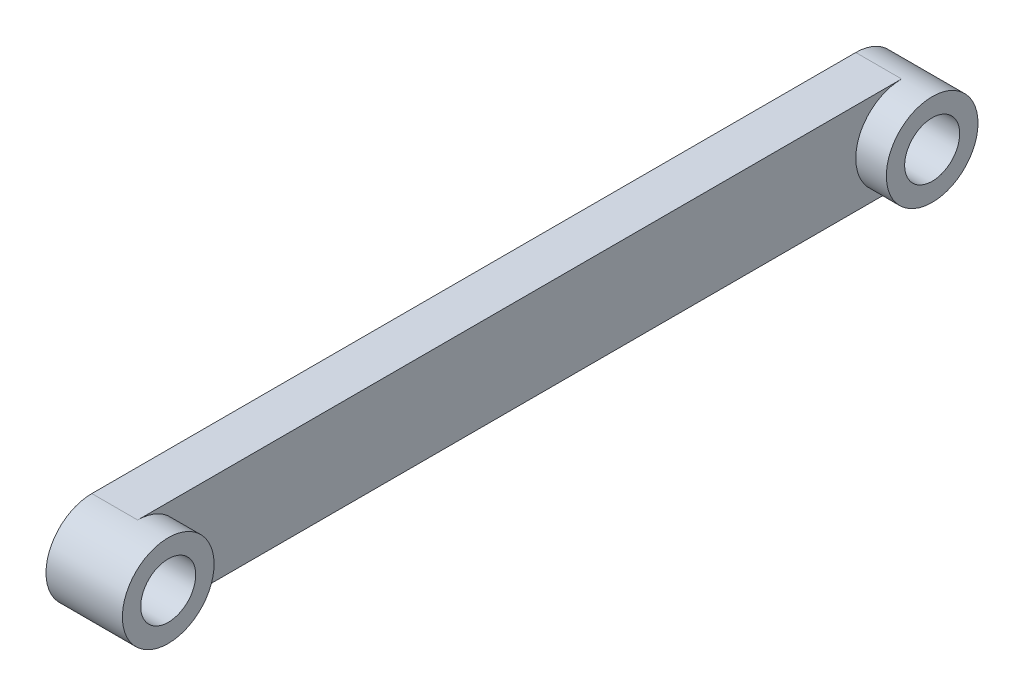
ISO-10303-21;
HEADER;
FILE_DESCRIPTION(('STEP AP214'),'2;1');
FILE_NAME('part.step','',(''),(''),'','','');
FILE_SCHEMA(('AUTOMOTIVE_DESIGN { 1 0 10303 214 1 1 1 1 }'));
ENDSEC;
DATA;
#1=APPLICATION_CONTEXT('core data for automotive mechanical design processes');
#2=APPLICATION_PROTOCOL_DEFINITION('international standard','automotive_design',2000,#1);
#3=PRODUCT_CONTEXT('',#1,'mechanical');
#4=PRODUCT('Part','Part','',(#3));
#5=PRODUCT_RELATED_PRODUCT_CATEGORY('part','',(#4));
#6=PRODUCT_DEFINITION_FORMATION('','',#4);
#7=PRODUCT_DEFINITION_CONTEXT('part definition',#1,'design');
#8=PRODUCT_DEFINITION('design','',#6,#7);
#9=PRODUCT_DEFINITION_SHAPE('','',#8);
#10=(LENGTH_UNIT() NAMED_UNIT(*) SI_UNIT(.MILLI.,.METRE.));
#11=(NAMED_UNIT(*) PLANE_ANGLE_UNIT() SI_UNIT($,.RADIAN.));
#12=(NAMED_UNIT(*) SI_UNIT($,.STERADIAN.) SOLID_ANGLE_UNIT());
#13=UNCERTAINTY_MEASURE_WITH_UNIT(LENGTH_MEASURE(1.E-05),#10,'distance_accuracy_value','');
#14=(GEOMETRIC_REPRESENTATION_CONTEXT(3) GLOBAL_UNCERTAINTY_ASSIGNED_CONTEXT((#13)) GLOBAL_UNIT_ASSIGNED_CONTEXT((#10,
#11,#12)) REPRESENTATION_CONTEXT('',''));
#15=CARTESIAN_POINT('',(0.,0.,0.));
#16=DIRECTION('',(0.,0.,1.));
#17=DIRECTION('',(1.,0.,0.));
#18=AXIS2_PLACEMENT_3D('',#15,#16,#17);
#19=CARTESIAN_POINT('',(3.,6.5627112660641,66.6032583111451));
#20=DIRECTION('',(1.,0.,0.));
#21=DIRECTION('',(0.,0.,-1.));
#22=AXIS2_PLACEMENT_3D('',#19,#20,#21);
#23=PLANE('',#22);
#24=DIRECTION('',(0.,0.,-1.));
#25=VECTOR('',#24,1.);
#26=CARTESIAN_POINT('',(3.,3.5627112660641,66.6032583111451));
#27=LINE('',#26,#25);
#28=CARTESIAN_POINT('',(3.,3.5627112660641,66.6032583111451));
#29=VERTEX_POINT('',#28);
#30=CARTESIAN_POINT('',(3.,3.5627112660641,16.6032583111451));
#31=VERTEX_POINT('',#30);
#32=EDGE_CURVE('E58',#29,#31,#27,.T.);
#33=ORIENTED_EDGE('',*,*,#32,.T.);
#34=CARTESIAN_POINT('',(3.,6.5627112660641,16.6032583111451));
#35=DIRECTION('',(1.,0.,0.));
#36=DIRECTION('',(0.,0.,-1.));
#37=AXIS2_PLACEMENT_3D('',#34,#35,#36);
#38=CIRCLE('',#37,3.);
#39=CARTESIAN_POINT('',(3.,9.5627112660641,16.6032583111451));
#40=VERTEX_POINT('',#39);
#41=EDGE_CURVE('E140',#40,#31,#38,.T.);
#42=ORIENTED_EDGE('',*,*,#41,.F.);
#43=DIRECTION('',(0.,0.,1.));
#44=VECTOR('',#43,1.);
#45=CARTESIAN_POINT('',(3.,9.5627112660641,66.6032583111451));
#46=LINE('',#45,#44);
#47=CARTESIAN_POINT('',(3.,9.56271126606411,66.6032583111451));
#48=VERTEX_POINT('',#47);
#49=EDGE_CURVE('E98',#40,#48,#46,.T.);
#50=ORIENTED_EDGE('',*,*,#49,.T.);
#51=CARTESIAN_POINT('',(3.,6.5627112660641,66.6032583111451));
#52=DIRECTION('',(1.,0.,0.));
#53=DIRECTION('',(0.,0.,-1.));
#54=AXIS2_PLACEMENT_3D('',#51,#52,#53);
#55=CIRCLE('',#54,3.00000000000001);
#56=EDGE_CURVE('E11',#29,#48,#55,.T.);
#57=ORIENTED_EDGE('',*,*,#56,.F.);
#58=EDGE_LOOP('',(#33,#42,#50,#57));
#59=FACE_BOUND('',#58,.T.);
#60=ADVANCED_FACE('F39',(#59),#23,.T.);
#61=CARTESIAN_POINT('',(0.,6.5627112660641,66.6032583111451));
#62=DIRECTION('',(1.,0.,0.));
#63=DIRECTION('',(0.,0.,-1.));
#64=AXIS2_PLACEMENT_3D('',#61,#62,#63);
#65=PLANE('',#64);
#66=CARTESIAN_POINT('',(0.,6.5627112660641,66.6032583111451));
#67=DIRECTION('',(1.,0.,0.));
#68=DIRECTION('',(0.,0.,-1.));
#69=AXIS2_PLACEMENT_3D('',#66,#67,#68);
#70=CIRCLE('',#69,3.);
#71=CARTESIAN_POINT('',(0.,9.5627112660641,66.6032583111451));
#72=VERTEX_POINT('',#71);
#73=CARTESIAN_POINT('',(0.,3.5627112660641,66.6032583111451));
#74=VERTEX_POINT('',#73);
#75=EDGE_CURVE('E96',#72,#74,#70,.T.);
#76=ORIENTED_EDGE('',*,*,#75,.F.);
#77=DIRECTION('',(0.,0.,1.));
#78=VECTOR('',#77,1.);
#79=CARTESIAN_POINT('',(0.,9.5627112660641,66.6032583111451));
#80=LINE('',#79,#78);
#81=CARTESIAN_POINT('',(0.,9.5627112660641,16.6032583111451));
#82=VERTEX_POINT('',#81);
#83=EDGE_CURVE('E81',#82,#72,#80,.T.);
#84=ORIENTED_EDGE('',*,*,#83,.F.);
#85=CARTESIAN_POINT('',(0.,6.5627112660641,16.6032583111451));
#86=DIRECTION('',(1.,0.,0.));
#87=DIRECTION('',(0.,0.,-1.));
#88=AXIS2_PLACEMENT_3D('',#85,#86,#87);
#89=CIRCLE('',#88,3.);
#90=CARTESIAN_POINT('',(0.,3.5627112660641,16.6032583111451));
#91=VERTEX_POINT('',#90);
#92=EDGE_CURVE('E75',#91,#82,#89,.T.);
#93=ORIENTED_EDGE('',*,*,#92,.F.);
#94=DIRECTION('',(0.,0.,-1.));
#95=VECTOR('',#94,1.);
#96=CARTESIAN_POINT('',(0.,3.5627112660641,66.6032583111451));
#97=LINE('',#96,#95);
#98=EDGE_CURVE('E102',#74,#91,#97,.T.);
#99=ORIENTED_EDGE('',*,*,#98,.F.);
#100=EDGE_LOOP('',(#76,#84,#93,#99));
#101=FACE_BOUND('',#100,.T.);
#102=CARTESIAN_POINT('',(0.,6.5627112660641,66.6032583111451));
#103=DIRECTION('',(1.,0.,0.));
#104=DIRECTION('',(0.,0.,-1.));
#105=AXIS2_PLACEMENT_3D('',#102,#103,#104);
#106=CIRCLE('',#105,1.79999999999999);
#107=CARTESIAN_POINT('',(0.,6.5627112660641,64.8032583111451));
#108=VERTEX_POINT('',#107);
#109=EDGE_CURVE('E105',#108,#108,#106,.T.);
#110=ORIENTED_EDGE('',*,*,#109,.T.);
#111=EDGE_LOOP('',(#110));
#112=FACE_BOUND('',#111,.T.);
#113=CARTESIAN_POINT('',(0.,6.5627112660641,16.6032583111451));
#114=DIRECTION('',(1.,0.,0.));
#115=DIRECTION('',(0.,0.,-1.));
#116=AXIS2_PLACEMENT_3D('',#113,#114,#115);
#117=CIRCLE('',#116,1.8);
#118=CARTESIAN_POINT('',(0.,6.5627112660641,14.8032583111451));
#119=VERTEX_POINT('',#118);
#120=EDGE_CURVE('E111',#119,#119,#117,.T.);
#121=ORIENTED_EDGE('',*,*,#120,.T.);
#122=EDGE_LOOP('',(#121));
#123=FACE_BOUND('',#122,.T.);
#124=ADVANCED_FACE('F100',(#101,#112,#123),#65,.F.);
#125=CARTESIAN_POINT('',(3.,6.5627112660641,66.6032583111451));
#126=DIRECTION('',(-1.,0.,0.));
#127=DIRECTION('',(0.,0.,1.));
#128=AXIS2_PLACEMENT_3D('',#125,#126,#127);
#129=CYLINDRICAL_SURFACE('',#128,3.);
#130=ORIENTED_EDGE('',*,*,#75,.T.);
#131=DIRECTION('',(-1.,0.,0.));
#132=VECTOR('',#131,1.);
#133=CARTESIAN_POINT('',(3.,3.5627112660641,66.6032583111451));
#134=LINE('',#133,#132);
#135=EDGE_CURVE('E43',#29,#74,#134,.T.);
#136=ORIENTED_EDGE('',*,*,#135,.F.);
#137=ORIENTED_EDGE('',*,*,#56,.T.);
#138=DIRECTION('',(-1.,0.,0.));
#139=VECTOR('',#138,1.);
#140=CARTESIAN_POINT('',(3.,9.5627112660641,66.6032583111451));
#141=LINE('',#140,#139);
#142=EDGE_CURVE('E85',#48,#72,#141,.T.);
#143=ORIENTED_EDGE('',*,*,#142,.T.);
#144=EDGE_LOOP('',(#130,#136,#137,#143));
#145=FACE_BOUND('',#144,.T.);
#146=CARTESIAN_POINT('',(5.,6.5627112660641,66.6032583111451));
#147=DIRECTION('',(1.,0.,0.));
#148=DIRECTION('',(0.,0.,-1.));
#149=AXIS2_PLACEMENT_3D('',#146,#147,#148);
#150=CIRCLE('',#149,3.00000000000001);
#151=CARTESIAN_POINT('',(5.,6.5627112660641,63.6032583111451));
#152=VERTEX_POINT('',#151);
#153=EDGE_CURVE('E130',#152,#152,#150,.T.);
#154=ORIENTED_EDGE('',*,*,#153,.F.);
#155=EDGE_LOOP('',(#154));
#156=FACE_BOUND('',#155,.T.);
#157=ADVANCED_FACE('F41',(#145,#156),#129,.T.);
#158=CARTESIAN_POINT('',(3.,3.5627112660641,66.6032583111451));
#159=DIRECTION('',(0.,1.,0.));
#160=DIRECTION('',(0.,0.,1.));
#161=AXIS2_PLACEMENT_3D('',#158,#159,#160);
#162=PLANE('',#161);
#163=ORIENTED_EDGE('',*,*,#98,.T.);
#164=DIRECTION('',(-1.,0.,0.));
#165=VECTOR('',#164,1.);
#166=CARTESIAN_POINT('',(3.,3.5627112660641,16.6032583111451));
#167=LINE('',#166,#165);
#168=EDGE_CURVE('E119',#31,#91,#167,.T.);
#169=ORIENTED_EDGE('',*,*,#168,.F.);
#170=ORIENTED_EDGE('',*,*,#32,.F.);
#171=ORIENTED_EDGE('',*,*,#135,.T.);
#172=EDGE_LOOP('',(#163,#169,#170,#171));
#173=FACE_BOUND('',#172,.T.);
#174=ADVANCED_FACE('F124',(#173),#162,.F.);
#175=CARTESIAN_POINT('',(3.,6.5627112660641,16.6032583111451));
#176=DIRECTION('',(-1.,0.,0.));
#177=DIRECTION('',(0.,0.,1.));
#178=AXIS2_PLACEMENT_3D('',#175,#176,#177);
#179=CYLINDRICAL_SURFACE('',#178,3.);
#180=ORIENTED_EDGE('',*,*,#92,.T.);
#181=DIRECTION('',(-1.,0.,0.));
#182=VECTOR('',#181,1.);
#183=CARTESIAN_POINT('',(3.,9.5627112660641,16.6032583111451));
#184=LINE('',#183,#182);
#185=EDGE_CURVE('E87',#40,#82,#184,.T.);
#186=ORIENTED_EDGE('',*,*,#185,.F.);
#187=ORIENTED_EDGE('',*,*,#41,.T.);
#188=ORIENTED_EDGE('',*,*,#168,.T.);
#189=EDGE_LOOP('',(#180,#186,#187,#188));
#190=FACE_BOUND('',#189,.T.);
#191=CARTESIAN_POINT('',(5.,6.5627112660641,16.6032583111451));
#192=DIRECTION('',(1.,0.,0.));
#193=DIRECTION('',(0.,0.,-1.));
#194=AXIS2_PLACEMENT_3D('',#191,#192,#193);
#195=CIRCLE('',#194,3.);
#196=CARTESIAN_POINT('',(5.,6.5627112660641,13.6032583111451));
#197=VERTEX_POINT('',#196);
#198=EDGE_CURVE('E139',#197,#197,#195,.T.);
#199=ORIENTED_EDGE('',*,*,#198,.F.);
#200=EDGE_LOOP('',(#199));
#201=FACE_BOUND('',#200,.T.);
#202=ADVANCED_FACE('F175',(#190,#201),#179,.T.);
#203=CARTESIAN_POINT('',(3.,9.5627112660641,66.6032583111451));
#204=DIRECTION('',(0.,-1.,0.));
#205=DIRECTION('',(0.,0.,-1.));
#206=AXIS2_PLACEMENT_3D('',#203,#204,#205);
#207=PLANE('',#206);
#208=ORIENTED_EDGE('',*,*,#83,.T.);
#209=ORIENTED_EDGE('',*,*,#142,.F.);
#210=ORIENTED_EDGE('',*,*,#49,.F.);
#211=ORIENTED_EDGE('',*,*,#185,.T.);
#212=EDGE_LOOP('',(#208,#209,#210,#211));
#213=FACE_BOUND('',#212,.T.);
#214=ADVANCED_FACE('F83',(#213),#207,.F.);
#215=CARTESIAN_POINT('',(3.,6.5627112660641,66.6032583111451));
#216=DIRECTION('',(-1.,0.,0.));
#217=DIRECTION('',(0.,0.,1.));
#218=AXIS2_PLACEMENT_3D('',#215,#216,#217);
#219=CYLINDRICAL_SURFACE('',#218,1.79999999999999);
#220=ORIENTED_EDGE('',*,*,#109,.F.);
#221=EDGE_LOOP('',(#220));
#222=FACE_BOUND('',#221,.T.);
#223=CARTESIAN_POINT('',(5.,6.5627112660641,66.6032583111451));
#224=DIRECTION('',(1.,0.,0.));
#225=DIRECTION('',(0.,0.,-1.));
#226=AXIS2_PLACEMENT_3D('',#223,#224,#225);
#227=CIRCLE('',#226,1.79999999999999);
#228=CARTESIAN_POINT('',(5.,6.5627112660641,64.8032583111451));
#229=VERTEX_POINT('',#228);
#230=EDGE_CURVE('E135',#229,#229,#227,.T.);
#231=ORIENTED_EDGE('',*,*,#230,.T.);
#232=EDGE_LOOP('',(#231));
#233=FACE_BOUND('',#232,.T.);
#234=ADVANCED_FACE('F170',(#222,#233),#219,.F.);
#235=CARTESIAN_POINT('',(3.,6.5627112660641,16.6032583111451));
#236=DIRECTION('',(-1.,0.,0.));
#237=DIRECTION('',(0.,0.,1.));
#238=AXIS2_PLACEMENT_3D('',#235,#236,#237);
#239=CYLINDRICAL_SURFACE('',#238,1.8);
#240=ORIENTED_EDGE('',*,*,#120,.F.);
#241=EDGE_LOOP('',(#240));
#242=FACE_BOUND('',#241,.T.);
#243=CARTESIAN_POINT('',(5.,6.5627112660641,16.6032583111451));
#244=DIRECTION('',(1.,0.,0.));
#245=DIRECTION('',(0.,0.,-1.));
#246=AXIS2_PLACEMENT_3D('',#243,#244,#245);
#247=CIRCLE('',#246,1.8);
#248=CARTESIAN_POINT('',(5.,6.5627112660641,14.8032583111451));
#249=VERTEX_POINT('',#248);
#250=EDGE_CURVE('E143',#249,#249,#247,.T.);
#251=ORIENTED_EDGE('',*,*,#250,.T.);
#252=EDGE_LOOP('',(#251));
#253=FACE_BOUND('',#252,.T.);
#254=ADVANCED_FACE('F151',(#242,#253),#239,.F.);
#255=CARTESIAN_POINT('',(5.,6.5627112660641,66.6032583111451));
#256=DIRECTION('',(1.,0.,0.));
#257=DIRECTION('',(0.,0.,-1.));
#258=AXIS2_PLACEMENT_3D('',#255,#256,#257);
#259=PLANE('',#258);
#260=ORIENTED_EDGE('',*,*,#153,.T.);
#261=EDGE_LOOP('',(#260));
#262=FACE_BOUND('',#261,.T.);
#263=ORIENTED_EDGE('',*,*,#230,.F.);
#264=EDGE_LOOP('',(#263));
#265=FACE_BOUND('',#264,.T.);
#266=ADVANCED_FACE('F155',(#262,#265),#259,.T.);
#267=CARTESIAN_POINT('',(5.,6.5627112660641,16.6032583111451));
#268=DIRECTION('',(1.,0.,0.));
#269=DIRECTION('',(0.,0.,-1.));
#270=AXIS2_PLACEMENT_3D('',#267,#268,#269);
#271=PLANE('',#270);
#272=ORIENTED_EDGE('',*,*,#198,.T.);
#273=EDGE_LOOP('',(#272));
#274=FACE_BOUND('',#273,.T.);
#275=ORIENTED_EDGE('',*,*,#250,.F.);
#276=EDGE_LOOP('',(#275));
#277=FACE_BOUND('',#276,.T.);
#278=ADVANCED_FACE('F153',(#274,#277),#271,.T.);
#279=CLOSED_SHELL('',(#60,#124,#157,#174,#202,#214,#234,#254,#266,#278));
#280=MANIFOLD_SOLID_BREP('B2',#279);
#281=ADVANCED_BREP_SHAPE_REPRESENTATION('',(#18,#280),#14);
#282=SHAPE_DEFINITION_REPRESENTATION(#9,#281);
ENDSEC;
END-ISO-10303-21;
